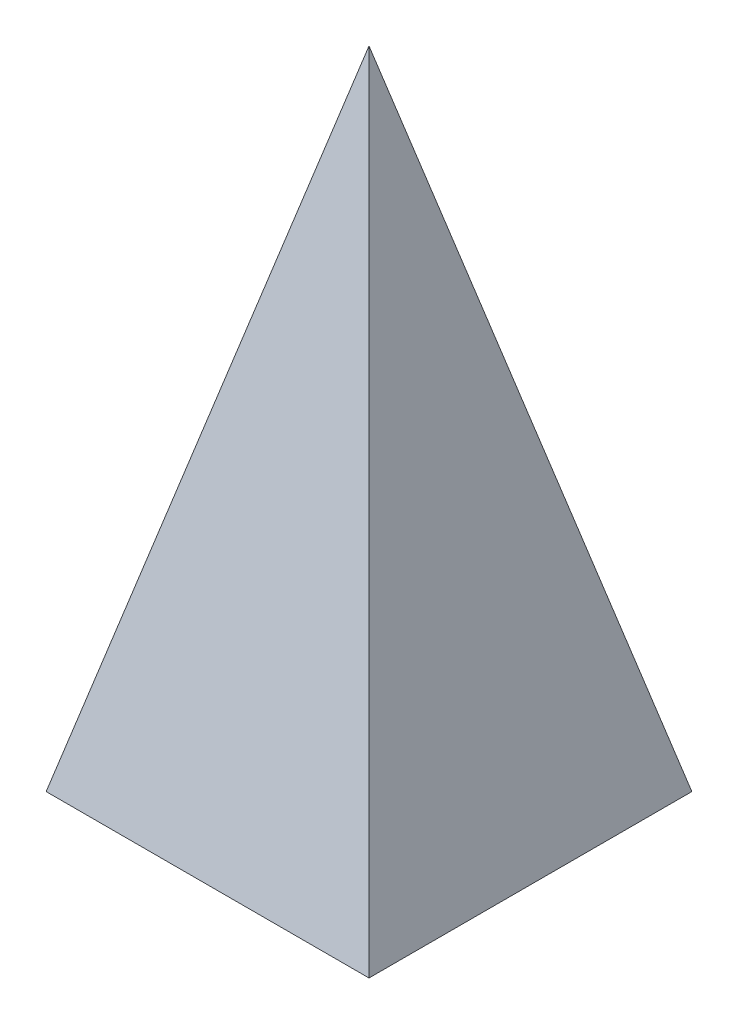
ISO-10303-21;
HEADER;
FILE_DESCRIPTION(('STEP AP214'),'2;1');
FILE_NAME('part.step','',(''),(''),'','','');
FILE_SCHEMA(('AUTOMOTIVE_DESIGN { 1 0 10303 214 1 1 1 1 }'));
ENDSEC;
DATA;
#1=APPLICATION_CONTEXT('core data for automotive mechanical design processes');
#2=APPLICATION_PROTOCOL_DEFINITION('international standard','automotive_design',2000,#1);
#3=PRODUCT_CONTEXT('',#1,'mechanical');
#4=PRODUCT('Part','Part','',(#3));
#5=PRODUCT_RELATED_PRODUCT_CATEGORY('part','',(#4));
#6=PRODUCT_DEFINITION_FORMATION('','',#4);
#7=PRODUCT_DEFINITION_CONTEXT('part definition',#1,'design');
#8=PRODUCT_DEFINITION('design','',#6,#7);
#9=PRODUCT_DEFINITION_SHAPE('','',#8);
#10=(LENGTH_UNIT() NAMED_UNIT(*) SI_UNIT(.MILLI.,.METRE.));
#11=(NAMED_UNIT(*) PLANE_ANGLE_UNIT() SI_UNIT($,.RADIAN.));
#12=(NAMED_UNIT(*) SI_UNIT($,.STERADIAN.) SOLID_ANGLE_UNIT());
#13=UNCERTAINTY_MEASURE_WITH_UNIT(LENGTH_MEASURE(1.E-05),#10,'distance_accuracy_value','');
#14=(GEOMETRIC_REPRESENTATION_CONTEXT(3) GLOBAL_UNCERTAINTY_ASSIGNED_CONTEXT((#13)) GLOBAL_UNIT_ASSIGNED_CONTEXT((#10,
#11,#12)) REPRESENTATION_CONTEXT('',''));
#15=CARTESIAN_POINT('',(0.,0.,0.));
#16=DIRECTION('',(0.,0.,1.));
#17=DIRECTION('',(1.,0.,0.));
#18=AXIS2_PLACEMENT_3D('',#15,#16,#17);
#19=CARTESIAN_POINT('',(-5.,0.,5.));
#20=DIRECTION('',(0.,1.,0.));
#21=DIRECTION('',(0.,0.,1.));
#22=AXIS2_PLACEMENT_3D('',#19,#20,#21);
#23=PLANE('',#22);
#24=DIRECTION('',(0.,0.,1.));
#25=VECTOR('',#24,1.);
#26=CARTESIAN_POINT('',(-5.,0.,-5.));
#27=LINE('',#26,#25);
#28=CARTESIAN_POINT('',(-5.,0.,-5.));
#29=VERTEX_POINT('',#28);
#30=CARTESIAN_POINT('',(-5.,0.,5.));
#31=VERTEX_POINT('',#30);
#32=EDGE_CURVE('E73',#29,#31,#27,.T.);
#33=ORIENTED_EDGE('',*,*,#32,.F.);
#34=DIRECTION('',(-1.,0.,0.));
#35=VECTOR('',#34,1.);
#36=CARTESIAN_POINT('',(-5.,0.,-5.));
#37=LINE('',#36,#35);
#38=CARTESIAN_POINT('',(5.,0.,-5.));
#39=VERTEX_POINT('',#38);
#40=EDGE_CURVE('E12',#39,#29,#37,.T.);
#41=ORIENTED_EDGE('',*,*,#40,.F.);
#42=DIRECTION('',(0.,0.,-1.));
#43=VECTOR('',#42,1.);
#44=CARTESIAN_POINT('',(5.,0.,-5.));
#45=LINE('',#44,#43);
#46=CARTESIAN_POINT('',(5.,0.,5.));
#47=VERTEX_POINT('',#46);
#48=EDGE_CURVE('E44',#47,#39,#45,.T.);
#49=ORIENTED_EDGE('',*,*,#48,.F.);
#50=DIRECTION('',(1.,0.,0.));
#51=VECTOR('',#50,1.);
#52=CARTESIAN_POINT('',(-5.,0.,5.));
#53=LINE('',#52,#51);
#54=EDGE_CURVE('E52',#31,#47,#53,.T.);
#55=ORIENTED_EDGE('',*,*,#54,.F.);
#56=EDGE_LOOP('',(#33,#41,#49,#55));
#57=FACE_BOUND('',#56,.T.);
#58=ADVANCED_FACE('F34',(#57),#23,.F.);
#59=CARTESIAN_POINT('',(5.,0.,5.));
#60=DIRECTION('',(0.970142500145332,0.242535625036333,0.));
#61=DIRECTION('',(-0.242535625036333,0.970142500145332,0.));
#62=AXIS2_PLACEMENT_3D('',#59,#60,#61);
#63=PLANE('',#62);
#64=DIRECTION('',(0.235702260395516,-0.942809041582063,0.235702260395516));
#65=VECTOR('',#64,1.);
#66=CARTESIAN_POINT('',(0.,20.,0.));
#67=LINE('',#66,#65);
#68=CARTESIAN_POINT('',(0.,20.,0.));
#69=VERTEX_POINT('',#68);
#70=EDGE_CURVE('E76',#69,#47,#67,.T.);
#71=ORIENTED_EDGE('',*,*,#70,.T.);
#72=ORIENTED_EDGE('',*,*,#48,.T.);
#73=DIRECTION('',(0.235702260395516,-0.942809041582063,-0.235702260395516));
#74=VECTOR('',#73,1.);
#75=CARTESIAN_POINT('',(0.,20.,0.));
#76=LINE('',#75,#74);
#77=EDGE_CURVE('E83',#69,#39,#76,.T.);
#78=ORIENTED_EDGE('',*,*,#77,.F.);
#79=EDGE_LOOP('',(#71,#72,#78));
#80=FACE_BOUND('',#79,.T.);
#81=ADVANCED_FACE('F86',(#80),#63,.T.);
#82=CARTESIAN_POINT('',(5.,0.,-5.));
#83=DIRECTION('',(0.,0.242535625036333,-0.970142500145332));
#84=DIRECTION('',(0.,0.970142500145332,0.242535625036333));
#85=AXIS2_PLACEMENT_3D('',#82,#83,#84);
#86=PLANE('',#85);
#87=ORIENTED_EDGE('',*,*,#77,.T.);
#88=ORIENTED_EDGE('',*,*,#40,.T.);
#89=DIRECTION('',(-0.235702260395516,-0.942809041582063,-0.235702260395516));
#90=VECTOR('',#89,1.);
#91=CARTESIAN_POINT('',(0.,20.,0.));
#92=LINE('',#91,#90);
#93=EDGE_CURVE('E72',#69,#29,#92,.T.);
#94=ORIENTED_EDGE('',*,*,#93,.F.);
#95=EDGE_LOOP('',(#87,#88,#94));
#96=FACE_BOUND('',#95,.T.);
#97=ADVANCED_FACE('F90',(#96),#86,.T.);
#98=CARTESIAN_POINT('',(-5.,0.,5.));
#99=DIRECTION('',(0.,0.242535625036333,0.970142500145332));
#100=DIRECTION('',(0.,-0.970142500145332,0.242535625036333));
#101=AXIS2_PLACEMENT_3D('',#98,#99,#100);
#102=PLANE('',#101);
#103=DIRECTION('',(-0.235702260395516,-0.942809041582063,0.235702260395516));
#104=VECTOR('',#103,1.);
#105=CARTESIAN_POINT('',(0.,20.,0.));
#106=LINE('',#105,#104);
#107=EDGE_CURVE('E68',#69,#31,#106,.T.);
#108=ORIENTED_EDGE('',*,*,#107,.T.);
#109=ORIENTED_EDGE('',*,*,#54,.T.);
#110=ORIENTED_EDGE('',*,*,#70,.F.);
#111=EDGE_LOOP('',(#108,#109,#110));
#112=FACE_BOUND('',#111,.T.);
#113=ADVANCED_FACE('F80',(#112),#102,.T.);
#114=CARTESIAN_POINT('',(-5.,0.,-5.));
#115=DIRECTION('',(-0.970142500145332,0.242535625036333,0.));
#116=DIRECTION('',(-0.242535625036333,-0.970142500145332,0.));
#117=AXIS2_PLACEMENT_3D('',#114,#115,#116);
#118=PLANE('',#117);
#119=ORIENTED_EDGE('',*,*,#93,.T.);
#120=ORIENTED_EDGE('',*,*,#32,.T.);
#121=ORIENTED_EDGE('',*,*,#107,.F.);
#122=EDGE_LOOP('',(#119,#120,#121));
#123=FACE_BOUND('',#122,.T.);
#124=ADVANCED_FACE('F70',(#123),#118,.T.);
#125=CLOSED_SHELL('',(#58,#81,#97,#113,#124));
#126=MANIFOLD_SOLID_BREP('B2',#125);
#127=ADVANCED_BREP_SHAPE_REPRESENTATION('',(#18,#126),#14);
#128=SHAPE_DEFINITION_REPRESENTATION(#9,#127);
ENDSEC;
END-ISO-10303-21;
